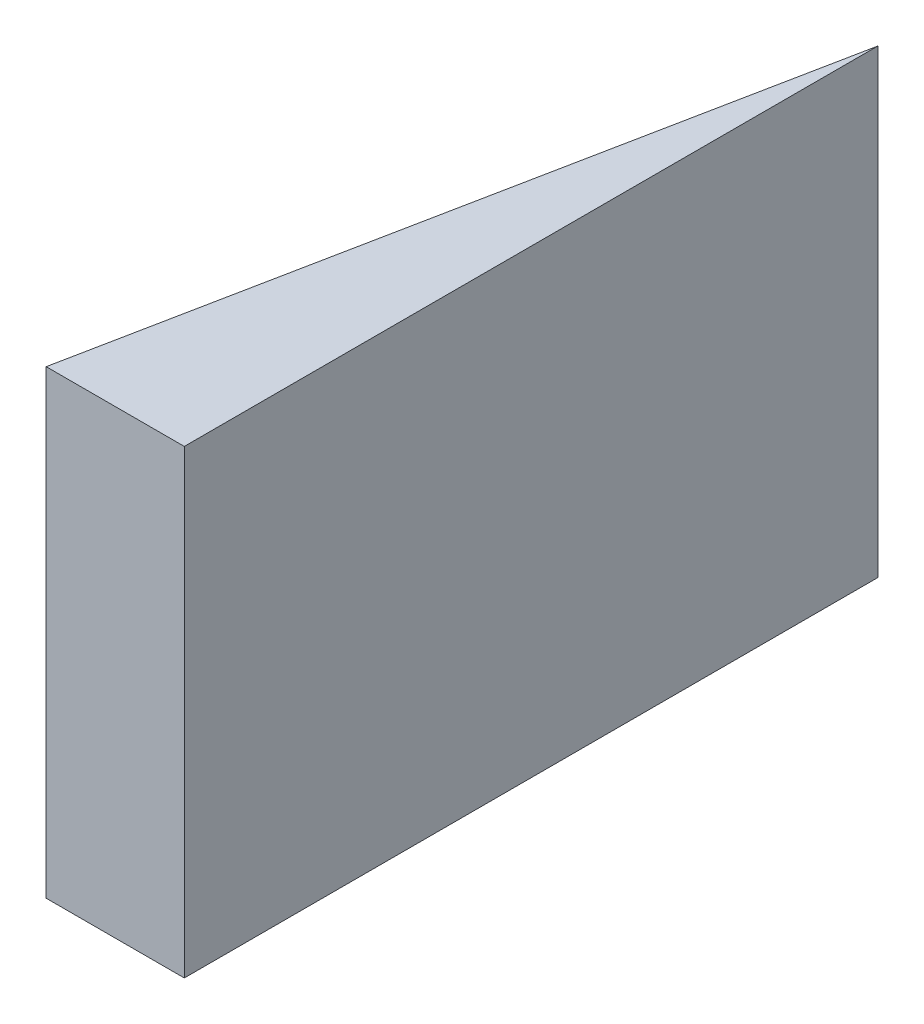
ISO-10303-21;
HEADER;
FILE_DESCRIPTION(('STEP AP214'),'2;1');
FILE_NAME('part.step','',(''),(''),'','','');
FILE_SCHEMA(('AUTOMOTIVE_DESIGN { 1 0 10303 214 1 1 1 1 }'));
ENDSEC;
DATA;
#1=APPLICATION_CONTEXT('core data for automotive mechanical design processes');
#2=APPLICATION_PROTOCOL_DEFINITION('international standard','automotive_design',2000,#1);
#3=PRODUCT_CONTEXT('',#1,'mechanical');
#4=PRODUCT('Part','Part','',(#3));
#5=PRODUCT_RELATED_PRODUCT_CATEGORY('part','',(#4));
#6=PRODUCT_DEFINITION_FORMATION('','',#4);
#7=PRODUCT_DEFINITION_CONTEXT('part definition',#1,'design');
#8=PRODUCT_DEFINITION('design','',#6,#7);
#9=PRODUCT_DEFINITION_SHAPE('','',#8);
#10=(LENGTH_UNIT() NAMED_UNIT(*) SI_UNIT(.MILLI.,.METRE.));
#11=(NAMED_UNIT(*) PLANE_ANGLE_UNIT() SI_UNIT($,.RADIAN.));
#12=(NAMED_UNIT(*) SI_UNIT($,.STERADIAN.) SOLID_ANGLE_UNIT());
#13=UNCERTAINTY_MEASURE_WITH_UNIT(LENGTH_MEASURE(1.E-05),#10,'distance_accuracy_value','');
#14=(GEOMETRIC_REPRESENTATION_CONTEXT(3) GLOBAL_UNCERTAINTY_ASSIGNED_CONTEXT((#13)) GLOBAL_UNIT_ASSIGNED_CONTEXT((#10,
#11,#12)) REPRESENTATION_CONTEXT('',''));
#15=CARTESIAN_POINT('',(0.,0.,0.));
#16=DIRECTION('',(0.,0.,1.));
#17=DIRECTION('',(1.,0.,0.));
#18=AXIS2_PLACEMENT_3D('',#15,#16,#17);
#19=CARTESIAN_POINT('',(-3.37532183744416,-0.749999364532665,-5.23287728793704));
#20=DIRECTION('',(-1.74845553146952E-07,-1.,8.74227765734759E-08));
#21=DIRECTION('',(1.,-1.74845553146952E-07,0.));
#22=AXIS2_PLACEMENT_3D('',#19,#20,#21);
#23=PLANE('',#22);
#24=DIRECTION('',(-0.999999999999985,1.74845553220964E-07,0.));
#25=VECTOR('',#24,1.);
#26=CARTESIAN_POINT('',(-3.00000013113415,-0.74999929187451,-3.65112145542903));
#27=LINE('',#26,#25);
#28=CARTESIAN_POINT('',(-3.00000013113415,-0.74999929187651,-3.65112145542903));
#29=VERTEX_POINT('',#28);
#30=CARTESIAN_POINT('',(-3.30000013113415,-0.749999239422844,-3.65112145543004));
#31=VERTEX_POINT('',#30);
#32=EDGE_CURVE('E11',#29,#31,#27,.T.);
#33=ORIENTED_EDGE('',*,*,#32,.F.);
#34=DIRECTION('',(0.,8.74227765663743E-08,0.999999999999996));
#35=VECTOR('',#34,1.);
#36=CARTESIAN_POINT('',(-3.00000013113416,-0.749999423571164,-5.15755558162703));
#37=LINE('',#36,#35);
#38=CARTESIAN_POINT('',(-3.00000013113416,-0.749999423573164,-5.15755558162603));
#39=VERTEX_POINT('',#38);
#40=EDGE_CURVE('E63',#39,#29,#37,.T.);
#41=ORIENTED_EDGE('',*,*,#40,.F.);
#42=DIRECTION('',(0.195310522456611,-1.19888317361196E-07,-0.980741454114035));
#43=VECTOR('',#42,1.);
#44=CARTESIAN_POINT('',(-3.30000013113415,-0.749999239420843,-3.65112145542904));
#45=LINE('',#44,#43);
#46=EDGE_CURVE('E70',#31,#39,#45,.T.);
#47=ORIENTED_EDGE('',*,*,#46,.F.);
#48=EDGE_LOOP('',(#33,#41,#47));
#49=FACE_BOUND('',#48,.T.);
#50=ADVANCED_FACE('F17',(#49),#23,.F.);
#51=CARTESIAN_POINT('',(-3.37532201228971,-1.74999936453367,-5.23287720051426));
#52=DIRECTION('',(-1.74845553146952E-07,-1.,8.74227765734759E-08));
#53=DIRECTION('',(1.,-1.74845553146952E-07,0.));
#54=AXIS2_PLACEMENT_3D('',#51,#52,#53);
#55=PLANE('',#54);
#56=DIRECTION('',(0.195310522456611,-1.19888317433476E-07,-0.980741454114035));
#57=VECTOR('',#56,1.);
#58=CARTESIAN_POINT('',(-3.3000003059797,-1.74999923942184,-3.65112136800626));
#59=LINE('',#58,#57);
#60=CARTESIAN_POINT('',(-3.3000003059797,-1.74999923942084,-3.65112136800726));
#61=VERTEX_POINT('',#60);
#62=CARTESIAN_POINT('',(-3.00000030597971,-1.74999942357116,-5.15755549420326));
#63=VERTEX_POINT('',#62);
#64=EDGE_CURVE('E24',#61,#63,#59,.T.);
#65=ORIENTED_EDGE('',*,*,#64,.T.);
#66=DIRECTION('',(0.,8.74227765663743E-08,0.999999999999996));
#67=VECTOR('',#66,1.);
#68=CARTESIAN_POINT('',(-3.00000030597971,-1.74999942357216,-5.15755549420426));
#69=LINE('',#68,#67);
#70=CARTESIAN_POINT('',(-3.0000003059797,-1.74999929187451,-3.65112136800626));
#71=VERTEX_POINT('',#70);
#72=EDGE_CURVE('E49',#63,#71,#69,.T.);
#73=ORIENTED_EDGE('',*,*,#72,.T.);
#74=DIRECTION('',(-0.999999999999985,1.74845553591038E-07,0.));
#75=VECTOR('',#74,1.);
#76=CARTESIAN_POINT('',(-3.0000003059797,-1.74999929187551,-3.65112136800626));
#77=LINE('',#76,#75);
#78=EDGE_CURVE('E46',#71,#61,#77,.T.);
#79=ORIENTED_EDGE('',*,*,#78,.T.);
#80=EDGE_LOOP('',(#65,#73,#79));
#81=FACE_BOUND('',#80,.T.);
#82=ADVANCED_FACE('F47',(#81),#55,.T.);
#83=CARTESIAN_POINT('',(-3.30000013113415,-0.749999239420844,-3.65112145542904));
#84=DIRECTION('',(-0.980741454114042,1.5440369389369E-07,-0.195310522456627));
#85=DIRECTION('',(0.195310522456612,-1.19888317353705E-07,-0.980741454114039));
#86=AXIS2_PLACEMENT_3D('',#83,#84,#85);
#87=PLANE('',#86);
#88=ORIENTED_EDGE('',*,*,#46,.T.);
#89=DIRECTION('',(-1.74845553146774E-07,-0.999999999999981,8.74227765733868E-08));
#90=VECTOR('',#89,1.);
#91=CARTESIAN_POINT('',(-3.00000013113416,-0.749999423571163,-5.15755558162703));
#92=LINE('',#91,#90);
#93=EDGE_CURVE('E54',#39,#63,#92,.T.);
#94=ORIENTED_EDGE('',*,*,#93,.T.);
#95=ORIENTED_EDGE('',*,*,#64,.F.);
#96=DIRECTION('',(-1.74845553146773E-07,-0.999999999999981,8.74227765733867E-08));
#97=VECTOR('',#96,1.);
#98=CARTESIAN_POINT('',(-3.30000013113415,-0.749999239420844,-3.65112145542904));
#99=LINE('',#98,#97);
#100=EDGE_CURVE('E61',#31,#61,#99,.T.);
#101=ORIENTED_EDGE('',*,*,#100,.F.);
#102=EDGE_LOOP('',(#88,#94,#95,#101));
#103=FACE_BOUND('',#102,.T.);
#104=ADVANCED_FACE('F60',(#103),#87,.T.);
#105=CARTESIAN_POINT('',(-3.00000013113416,-0.749999423571164,-5.15755558162703));
#106=DIRECTION('',(1.,-1.74845553146952E-07,0.));
#107=DIRECTION('',(0.,8.74227765734759E-08,1.));
#108=AXIS2_PLACEMENT_3D('',#105,#106,#107);
#109=PLANE('',#108);
#110=ORIENTED_EDGE('',*,*,#40,.T.);
#111=DIRECTION('',(-1.74845553146774E-07,-0.999999999999981,8.74227765733868E-08));
#112=VECTOR('',#111,1.);
#113=CARTESIAN_POINT('',(-3.00000013113415,-0.74999929187451,-3.65112145542903));
#114=LINE('',#113,#112);
#115=EDGE_CURVE('E55',#29,#71,#114,.T.);
#116=ORIENTED_EDGE('',*,*,#115,.T.);
#117=ORIENTED_EDGE('',*,*,#72,.F.);
#118=ORIENTED_EDGE('',*,*,#93,.F.);
#119=EDGE_LOOP('',(#110,#116,#117,#118));
#120=FACE_BOUND('',#119,.T.);
#121=ADVANCED_FACE('F73',(#120),#109,.T.);
#122=CARTESIAN_POINT('',(-3.00000013113415,-0.74999929187451,-3.65112145542903));
#123=DIRECTION('',(0.,8.74227765734759E-08,1.));
#124=DIRECTION('',(-1.,1.74845553146952E-07,0.));
#125=AXIS2_PLACEMENT_3D('',#122,#123,#124);
#126=PLANE('',#125);
#127=ORIENTED_EDGE('',*,*,#32,.T.);
#128=ORIENTED_EDGE('',*,*,#100,.T.);
#129=ORIENTED_EDGE('',*,*,#78,.F.);
#130=ORIENTED_EDGE('',*,*,#115,.F.);
#131=EDGE_LOOP('',(#127,#128,#129,#130));
#132=FACE_BOUND('',#131,.T.);
#133=ADVANCED_FACE('F64',(#132),#126,.T.);
#134=CLOSED_SHELL('',(#50,#82,#104,#121,#133));
#135=MANIFOLD_SOLID_BREP('B1',#134);
#136=ADVANCED_BREP_SHAPE_REPRESENTATION('',(#18,#135),#14);
#137=SHAPE_DEFINITION_REPRESENTATION(#9,#136);
ENDSEC;
END-ISO-10303-21;
